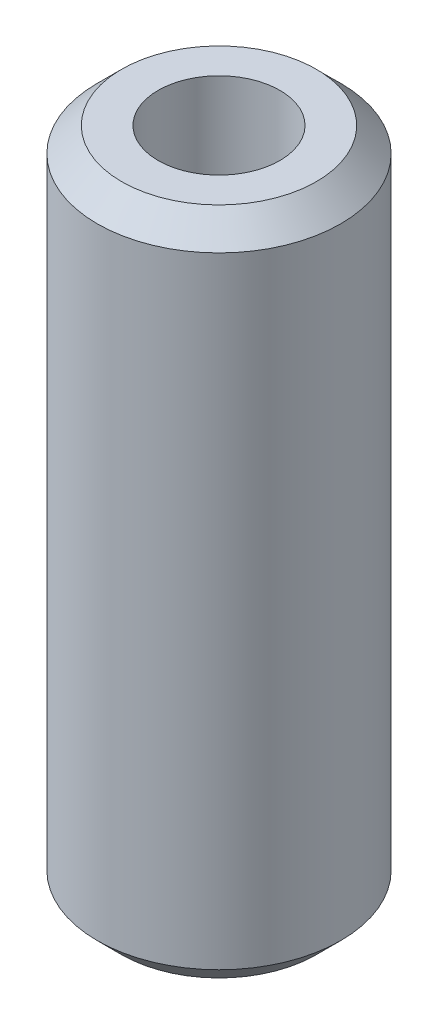
ISO-10303-21;
HEADER;
FILE_DESCRIPTION(('STEP AP214'),'2;1');
FILE_NAME('part.step','',(''),(''),'','','');
FILE_SCHEMA(('AUTOMOTIVE_DESIGN { 1 0 10303 214 1 1 1 1 }'));
ENDSEC;
DATA;
#1=APPLICATION_CONTEXT('core data for automotive mechanical design processes');
#2=APPLICATION_PROTOCOL_DEFINITION('international standard','automotive_design',2000,#1);
#3=PRODUCT_CONTEXT('',#1,'mechanical');
#4=PRODUCT('Part','Part','',(#3));
#5=PRODUCT_RELATED_PRODUCT_CATEGORY('part','',(#4));
#6=PRODUCT_DEFINITION_FORMATION('','',#4);
#7=PRODUCT_DEFINITION_CONTEXT('part definition',#1,'design');
#8=PRODUCT_DEFINITION('design','',#6,#7);
#9=PRODUCT_DEFINITION_SHAPE('','',#8);
#10=(LENGTH_UNIT() NAMED_UNIT(*) SI_UNIT(.MILLI.,.METRE.));
#11=(NAMED_UNIT(*) PLANE_ANGLE_UNIT() SI_UNIT($,.RADIAN.));
#12=(NAMED_UNIT(*) SI_UNIT($,.STERADIAN.) SOLID_ANGLE_UNIT());
#13=UNCERTAINTY_MEASURE_WITH_UNIT(LENGTH_MEASURE(1.E-05),#10,'distance_accuracy_value','');
#14=(GEOMETRIC_REPRESENTATION_CONTEXT(3) GLOBAL_UNCERTAINTY_ASSIGNED_CONTEXT((#13)) GLOBAL_UNIT_ASSIGNED_CONTEXT((#10,
#11,#12)) REPRESENTATION_CONTEXT('',''));
#15=CARTESIAN_POINT('',(0.,0.,0.));
#16=DIRECTION('',(0.,0.,1.));
#17=DIRECTION('',(1.,0.,0.));
#18=AXIS2_PLACEMENT_3D('',#15,#16,#17);
#19=CARTESIAN_POINT('',(0.,34.925,0.));
#20=DIRECTION('',(0.,1.,0.));
#21=DIRECTION('',(0.,0.,1.));
#22=AXIS2_PLACEMENT_3D('',#19,#20,#21);
#23=PLANE('',#22);
#24=CARTESIAN_POINT('',(0.,34.925,0.));
#25=DIRECTION('',(0.,1.,0.));
#26=DIRECTION('',(0.,0.,1.));
#27=AXIS2_PLACEMENT_3D('',#24,#25,#26);
#28=CIRCLE('',#27,10.16);
#29=CARTESIAN_POINT('',(0.,34.925,10.16));
#30=VERTEX_POINT('',#29);
#31=EDGE_CURVE('E10',#30,#30,#28,.T.);
#32=ORIENTED_EDGE('',*,*,#31,.T.);
#33=EDGE_LOOP('',(#32));
#34=FACE_BOUND('',#33,.T.);
#35=CARTESIAN_POINT('',(0.,34.925,0.));
#36=DIRECTION('',(0.,1.,0.));
#37=DIRECTION('',(0.,0.,1.));
#38=AXIS2_PLACEMENT_3D('',#35,#36,#37);
#39=CIRCLE('',#38,6.35);
#40=CARTESIAN_POINT('',(0.,34.925,6.35));
#41=VERTEX_POINT('',#40);
#42=EDGE_CURVE('E59',#41,#41,#39,.T.);
#43=ORIENTED_EDGE('',*,*,#42,.F.);
#44=EDGE_LOOP('',(#43));
#45=FACE_BOUND('',#44,.T.);
#46=ADVANCED_FACE('F38',(#34,#45),#23,.T.);
#47=CARTESIAN_POINT('',(0.,-34.925,0.));
#48=DIRECTION('',(0.,1.,0.));
#49=DIRECTION('',(0.,0.,1.));
#50=AXIS2_PLACEMENT_3D('',#47,#48,#49);
#51=PLANE('',#50);
#52=CARTESIAN_POINT('',(0.,-34.925,0.));
#53=DIRECTION('',(0.,1.,0.));
#54=DIRECTION('',(0.,0.,1.));
#55=AXIS2_PLACEMENT_3D('',#52,#53,#54);
#56=CIRCLE('',#55,10.16);
#57=CARTESIAN_POINT('',(0.,-34.925,10.16));
#58=VERTEX_POINT('',#57);
#59=EDGE_CURVE('E46',#58,#58,#56,.F.);
#60=ORIENTED_EDGE('',*,*,#59,.T.);
#61=EDGE_LOOP('',(#60));
#62=FACE_BOUND('',#61,.T.);
#63=CARTESIAN_POINT('',(0.,-34.925,0.));
#64=DIRECTION('',(0.,1.,0.));
#65=DIRECTION('',(0.,0.,1.));
#66=AXIS2_PLACEMENT_3D('',#63,#64,#65);
#67=CIRCLE('',#66,6.35);
#68=CARTESIAN_POINT('',(0.,-34.925,6.35));
#69=VERTEX_POINT('',#68);
#70=EDGE_CURVE('E60',#69,#69,#67,.T.);
#71=ORIENTED_EDGE('',*,*,#70,.T.);
#72=EDGE_LOOP('',(#71));
#73=FACE_BOUND('',#72,.T.);
#74=ADVANCED_FACE('F70',(#62,#73),#51,.F.);
#75=CARTESIAN_POINT('',(0.,34.925,0.));
#76=DIRECTION('',(0.,-1.,0.));
#77=DIRECTION('',(0.,0.,-1.));
#78=AXIS2_PLACEMENT_3D('',#75,#76,#77);
#79=CYLINDRICAL_SURFACE('',#78,12.7);
#80=CARTESIAN_POINT('',(0.,-32.385,0.));
#81=DIRECTION('',(0.,1.,0.));
#82=DIRECTION('',(0.,0.,1.));
#83=AXIS2_PLACEMENT_3D('',#80,#81,#82);
#84=CIRCLE('',#83,12.7);
#85=CARTESIAN_POINT('',(0.,-32.385,12.7));
#86=VERTEX_POINT('',#85);
#87=EDGE_CURVE('E50',#86,#86,#84,.T.);
#88=ORIENTED_EDGE('',*,*,#87,.T.);
#89=EDGE_LOOP('',(#88));
#90=FACE_BOUND('',#89,.T.);
#91=CARTESIAN_POINT('',(0.,32.385,0.));
#92=DIRECTION('',(0.,1.,0.));
#93=DIRECTION('',(0.,0.,1.));
#94=AXIS2_PLACEMENT_3D('',#91,#92,#93);
#95=CIRCLE('',#94,12.7);
#96=CARTESIAN_POINT('',(0.,32.385,12.7));
#97=VERTEX_POINT('',#96);
#98=EDGE_CURVE('E54',#97,#97,#95,.F.);
#99=ORIENTED_EDGE('',*,*,#98,.T.);
#100=EDGE_LOOP('',(#99));
#101=FACE_BOUND('',#100,.T.);
#102=ADVANCED_FACE('F75',(#90,#101),#79,.T.);
#103=CARTESIAN_POINT('',(0.,34.925,0.));
#104=DIRECTION('',(0.,-1.,0.));
#105=DIRECTION('',(0.,0.,-1.));
#106=AXIS2_PLACEMENT_3D('',#103,#104,#105);
#107=CYLINDRICAL_SURFACE('',#106,6.35);
#108=ORIENTED_EDGE('',*,*,#42,.T.);
#109=EDGE_LOOP('',(#108));
#110=FACE_BOUND('',#109,.T.);
#111=ORIENTED_EDGE('',*,*,#70,.F.);
#112=EDGE_LOOP('',(#111));
#113=FACE_BOUND('',#112,.T.);
#114=ADVANCED_FACE('F66',(#110,#113),#107,.F.);
#115=CARTESIAN_POINT('',(0.,-32.385,0.));
#116=DIRECTION('',(0.,1.,0.));
#117=DIRECTION('',(0.,0.,1.));
#118=AXIS2_PLACEMENT_3D('',#115,#116,#117);
#119=CONICAL_SURFACE('',#118,12.7,0.785398163397449);
#120=ORIENTED_EDGE('',*,*,#59,.F.);
#121=EDGE_LOOP('',(#120));
#122=FACE_BOUND('',#121,.T.);
#123=ORIENTED_EDGE('',*,*,#87,.F.);
#124=EDGE_LOOP('',(#123));
#125=FACE_BOUND('',#124,.T.);
#126=ADVANCED_FACE('F82',(#122,#125),#119,.T.);
#127=CARTESIAN_POINT('',(0.,34.925,0.));
#128=DIRECTION('',(0.,-1.,0.));
#129=DIRECTION('',(0.,0.,-1.));
#130=AXIS2_PLACEMENT_3D('',#127,#128,#129);
#131=CONICAL_SURFACE('',#130,10.16,0.785398163397446);
#132=ORIENTED_EDGE('',*,*,#98,.F.);
#133=EDGE_LOOP('',(#132));
#134=FACE_BOUND('',#133,.T.);
#135=ORIENTED_EDGE('',*,*,#31,.F.);
#136=EDGE_LOOP('',(#135));
#137=FACE_BOUND('',#136,.T.);
#138=ADVANCED_FACE('F41',(#134,#137),#131,.T.);
#139=CLOSED_SHELL('',(#46,#74,#102,#114,#126,#138));
#140=MANIFOLD_SOLID_BREP('B2',#139);
#141=ADVANCED_BREP_SHAPE_REPRESENTATION('',(#18,#140),#14);
#142=SHAPE_DEFINITION_REPRESENTATION(#9,#141);
ENDSEC;
END-ISO-10303-21;
